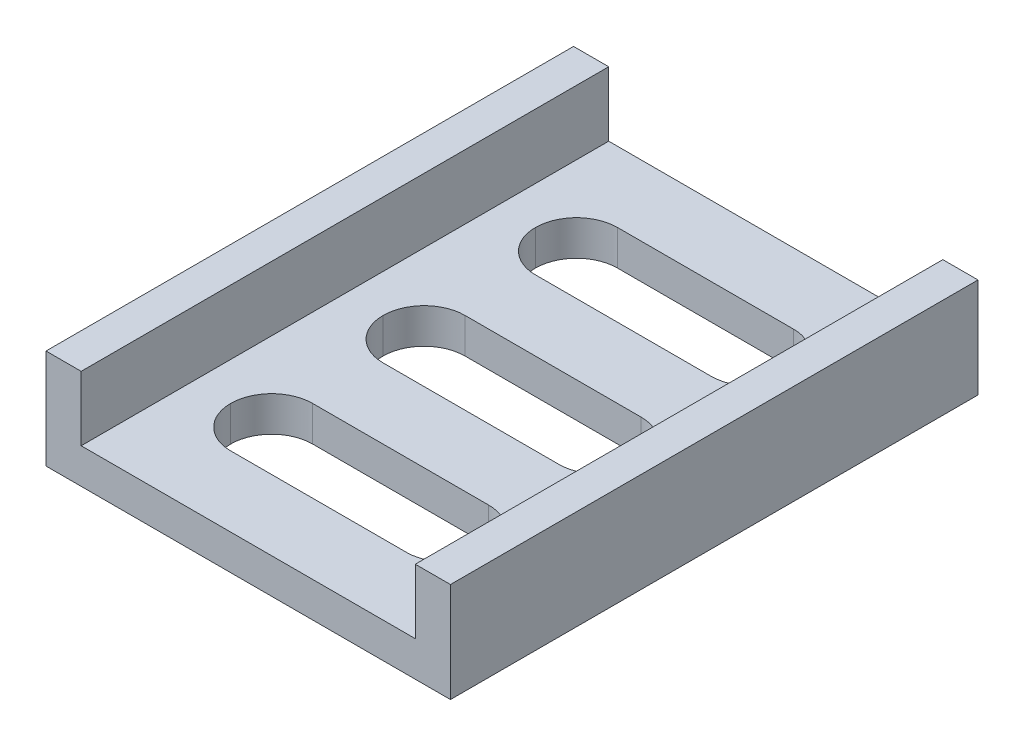
ISO-10303-21;
HEADER;
FILE_DESCRIPTION(('STEP AP214'),'2;1');
FILE_NAME('part.step','',(''),(''),'','','');
FILE_SCHEMA(('AUTOMOTIVE_DESIGN { 1 0 10303 214 1 1 1 1 }'));
ENDSEC;
DATA;
#1=APPLICATION_CONTEXT('core data for automotive mechanical design processes');
#2=APPLICATION_PROTOCOL_DEFINITION('international standard','automotive_design',2000,#1);
#3=PRODUCT_CONTEXT('',#1,'mechanical');
#4=PRODUCT('Part','Part','',(#3));
#5=PRODUCT_RELATED_PRODUCT_CATEGORY('part','',(#4));
#6=PRODUCT_DEFINITION_FORMATION('','',#4);
#7=PRODUCT_DEFINITION_CONTEXT('part definition',#1,'design');
#8=PRODUCT_DEFINITION('design','',#6,#7);
#9=PRODUCT_DEFINITION_SHAPE('','',#8);
#10=(LENGTH_UNIT() NAMED_UNIT(*) SI_UNIT(.MILLI.,.METRE.));
#11=(NAMED_UNIT(*) PLANE_ANGLE_UNIT() SI_UNIT($,.RADIAN.));
#12=(NAMED_UNIT(*) SI_UNIT($,.STERADIAN.) SOLID_ANGLE_UNIT());
#13=UNCERTAINTY_MEASURE_WITH_UNIT(LENGTH_MEASURE(1.E-05),#10,'distance_accuracy_value','');
#14=(GEOMETRIC_REPRESENTATION_CONTEXT(3) GLOBAL_UNCERTAINTY_ASSIGNED_CONTEXT((#13)) GLOBAL_UNIT_ASSIGNED_CONTEXT((#10,
#11,#12)) REPRESENTATION_CONTEXT('',''));
#15=CARTESIAN_POINT('',(0.,0.,0.));
#16=DIRECTION('',(0.,0.,1.));
#17=DIRECTION('',(1.,0.,0.));
#18=AXIS2_PLACEMENT_3D('',#15,#16,#17);
#19=CARTESIAN_POINT('',(0.,3.,0.));
#20=DIRECTION('',(0.,-1.,0.));
#21=DIRECTION('',(0.,0.,-1.));
#22=AXIS2_PLACEMENT_3D('',#19,#20,#21);
#23=PLANE('',#22);
#24=CARTESIAN_POINT('',(-7.49999999999998,3.,-13.));
#25=DIRECTION('',(0.,-1.,0.));
#26=DIRECTION('',(0.,0.,-1.));
#27=AXIS2_PLACEMENT_3D('',#24,#25,#26);
#28=CIRCLE('',#27,3.5);
#29=CARTESIAN_POINT('',(-7.49999999999998,3.,-9.5));
#30=VERTEX_POINT('',#29);
#31=CARTESIAN_POINT('',(-11.,3.,-13.));
#32=VERTEX_POINT('',#31);
#33=EDGE_CURVE('E305',#30,#32,#28,.T.);
#34=ORIENTED_EDGE('',*,*,#33,.T.);
#35=CARTESIAN_POINT('',(-7.49999999999998,3.,-13.));
#36=DIRECTION('',(0.,-1.,0.));
#37=DIRECTION('',(0.,0.,-1.));
#38=AXIS2_PLACEMENT_3D('',#35,#36,#37);
#39=CIRCLE('',#38,3.5);
#40=CARTESIAN_POINT('',(-7.49999999999998,3.,-16.5));
#41=VERTEX_POINT('',#40);
#42=EDGE_CURVE('E309',#32,#41,#39,.T.);
#43=ORIENTED_EDGE('',*,*,#42,.T.);
#44=DIRECTION('',(1.,0.,0.));
#45=VECTOR('',#44,1.);
#46=CARTESIAN_POINT('',(0.,3.,-16.5));
#47=LINE('',#46,#45);
#48=CARTESIAN_POINT('',(7.50000000000002,3.,-16.5));
#49=VERTEX_POINT('',#48);
#50=EDGE_CURVE('E730',#41,#49,#47,.T.);
#51=ORIENTED_EDGE('',*,*,#50,.T.);
#52=CARTESIAN_POINT('',(7.50000000000002,3.,-13.));
#53=DIRECTION('',(0.,-1.,0.));
#54=DIRECTION('',(0.,0.,-1.));
#55=AXIS2_PLACEMENT_3D('',#52,#53,#54);
#56=CIRCLE('',#55,3.5);
#57=CARTESIAN_POINT('',(11.,3.,-13.));
#58=VERTEX_POINT('',#57);
#59=EDGE_CURVE('E317',#49,#58,#56,.T.);
#60=ORIENTED_EDGE('',*,*,#59,.T.);
#61=CARTESIAN_POINT('',(7.50000000000002,3.,-13.));
#62=DIRECTION('',(0.,-1.,0.));
#63=DIRECTION('',(0.,0.,-1.));
#64=AXIS2_PLACEMENT_3D('',#61,#62,#63);
#65=CIRCLE('',#64,3.5);
#66=CARTESIAN_POINT('',(7.50000000000002,3.,-9.5));
#67=VERTEX_POINT('',#66);
#68=EDGE_CURVE('E313',#58,#67,#65,.T.);
#69=ORIENTED_EDGE('',*,*,#68,.T.);
#70=DIRECTION('',(-1.,0.,0.));
#71=VECTOR('',#70,1.);
#72=CARTESIAN_POINT('',(0.,3.,-9.5));
#73=LINE('',#72,#71);
#74=EDGE_CURVE('E733',#67,#30,#73,.T.);
#75=ORIENTED_EDGE('',*,*,#74,.T.);
#76=EDGE_LOOP('',(#34,#43,#51,#60,#69,#75));
#77=FACE_BOUND('',#76,.T.);
#78=DIRECTION('',(-1.,0.,0.));
#79=VECTOR('',#78,1.);
#80=CARTESIAN_POINT('',(0.,3.,3.5));
#81=LINE('',#80,#79);
#82=CARTESIAN_POINT('',(7.5,3.,3.5));
#83=VERTEX_POINT('',#82);
#84=CARTESIAN_POINT('',(-7.5,3.,3.5));
#85=VERTEX_POINT('',#84);
#86=EDGE_CURVE('E388',#83,#85,#81,.T.);
#87=ORIENTED_EDGE('',*,*,#86,.T.);
#88=CARTESIAN_POINT('',(-7.5,3.,0.));
#89=DIRECTION('',(0.,-1.,0.));
#90=DIRECTION('',(0.,0.,-1.));
#91=AXIS2_PLACEMENT_3D('',#88,#89,#90);
#92=CIRCLE('',#91,3.5);
#93=CARTESIAN_POINT('',(-11.,3.,0.));
#94=VERTEX_POINT('',#93);
#95=EDGE_CURVE('E329',#85,#94,#92,.T.);
#96=ORIENTED_EDGE('',*,*,#95,.T.);
#97=CARTESIAN_POINT('',(-7.5,3.,0.));
#98=DIRECTION('',(0.,-1.,0.));
#99=DIRECTION('',(0.,0.,-1.));
#100=AXIS2_PLACEMENT_3D('',#97,#98,#99);
#101=CIRCLE('',#100,3.5);
#102=CARTESIAN_POINT('',(-7.5,3.,-3.5));
#103=VERTEX_POINT('',#102);
#104=EDGE_CURVE('E325',#94,#103,#101,.T.);
#105=ORIENTED_EDGE('',*,*,#104,.T.);
#106=DIRECTION('',(1.,0.,0.));
#107=VECTOR('',#106,1.);
#108=CARTESIAN_POINT('',(0.,3.,-3.5));
#109=LINE('',#108,#107);
#110=CARTESIAN_POINT('',(7.5,3.,-3.5));
#111=VERTEX_POINT('',#110);
#112=EDGE_CURVE('E382',#103,#111,#109,.T.);
#113=ORIENTED_EDGE('',*,*,#112,.T.);
#114=CARTESIAN_POINT('',(7.5,3.,0.));
#115=DIRECTION('',(0.,-1.,0.));
#116=DIRECTION('',(0.,0.,-1.));
#117=AXIS2_PLACEMENT_3D('',#114,#115,#116);
#118=CIRCLE('',#117,3.5);
#119=CARTESIAN_POINT('',(11.,3.,0.));
#120=VERTEX_POINT('',#119);
#121=EDGE_CURVE('E321',#111,#120,#118,.T.);
#122=ORIENTED_EDGE('',*,*,#121,.T.);
#123=CARTESIAN_POINT('',(7.5,3.,0.));
#124=DIRECTION('',(0.,-1.,0.));
#125=DIRECTION('',(0.,0.,-1.));
#126=AXIS2_PLACEMENT_3D('',#123,#124,#125);
#127=CIRCLE('',#126,3.5);
#128=EDGE_CURVE('E333',#120,#83,#127,.T.);
#129=ORIENTED_EDGE('',*,*,#128,.T.);
#130=EDGE_LOOP('',(#87,#96,#105,#113,#122,#129));
#131=FACE_BOUND('',#130,.T.);
#132=DIRECTION('',(-1.,0.,0.));
#133=VECTOR('',#132,1.);
#134=CARTESIAN_POINT('',(0.,3.,16.5));
#135=LINE('',#134,#133);
#136=CARTESIAN_POINT('',(7.50000000000001,3.,16.5));
#137=VERTEX_POINT('',#136);
#138=CARTESIAN_POINT('',(-7.49999999999999,3.,16.5));
#139=VERTEX_POINT('',#138);
#140=EDGE_CURVE('E385',#137,#139,#135,.T.);
#141=ORIENTED_EDGE('',*,*,#140,.T.);
#142=CARTESIAN_POINT('',(-7.49999999999999,3.,13.));
#143=DIRECTION('',(0.,-1.,0.));
#144=DIRECTION('',(0.,0.,-1.));
#145=AXIS2_PLACEMENT_3D('',#142,#143,#144);
#146=CIRCLE('',#145,3.5);
#147=CARTESIAN_POINT('',(-11.,3.,13.));
#148=VERTEX_POINT('',#147);
#149=EDGE_CURVE('E11',#139,#148,#146,.T.);
#150=ORIENTED_EDGE('',*,*,#149,.T.);
#151=CARTESIAN_POINT('',(-7.49999999999999,3.,13.));
#152=DIRECTION('',(0.,-1.,0.));
#153=DIRECTION('',(0.,0.,-1.));
#154=AXIS2_PLACEMENT_3D('',#151,#152,#153);
#155=CIRCLE('',#154,3.5);
#156=CARTESIAN_POINT('',(-7.49999999999999,3.,9.5));
#157=VERTEX_POINT('',#156);
#158=EDGE_CURVE('E344',#148,#157,#155,.T.);
#159=ORIENTED_EDGE('',*,*,#158,.T.);
#160=DIRECTION('',(1.,0.,0.));
#161=VECTOR('',#160,1.);
#162=CARTESIAN_POINT('',(0.,3.,9.5));
#163=LINE('',#162,#161);
#164=CARTESIAN_POINT('',(7.50000000000001,3.,9.5));
#165=VERTEX_POINT('',#164);
#166=EDGE_CURVE('E393',#157,#165,#163,.T.);
#167=ORIENTED_EDGE('',*,*,#166,.T.);
#168=CARTESIAN_POINT('',(7.50000000000001,3.,13.));
#169=DIRECTION('',(0.,-1.,0.));
#170=DIRECTION('',(0.,0.,-1.));
#171=AXIS2_PLACEMENT_3D('',#168,#169,#170);
#172=CIRCLE('',#171,3.5);
#173=CARTESIAN_POINT('',(11.,3.,13.));
#174=VERTEX_POINT('',#173);
#175=EDGE_CURVE('E337',#165,#174,#172,.T.);
#176=ORIENTED_EDGE('',*,*,#175,.T.);
#177=CARTESIAN_POINT('',(7.50000000000001,3.,13.));
#178=DIRECTION('',(0.,-1.,0.));
#179=DIRECTION('',(0.,0.,-1.));
#180=AXIS2_PLACEMENT_3D('',#177,#178,#179);
#181=CIRCLE('',#180,3.5);
#182=EDGE_CURVE('E341',#174,#137,#181,.T.);
#183=ORIENTED_EDGE('',*,*,#182,.T.);
#184=EDGE_LOOP('',(#141,#150,#159,#167,#176,#183));
#185=FACE_BOUND('',#184,.T.);
#186=DIRECTION('',(0.,0.,1.));
#187=VECTOR('',#186,1.);
#188=CARTESIAN_POINT('',(14.25,3.,-22.5));
#189=LINE('',#188,#187);
#190=CARTESIAN_POINT('',(14.25,3.,-22.5));
#191=VERTEX_POINT('',#190);
#192=CARTESIAN_POINT('',(14.25,3.,22.5));
#193=VERTEX_POINT('',#192);
#194=EDGE_CURVE('E229',#191,#193,#189,.T.);
#195=ORIENTED_EDGE('',*,*,#194,.F.);
#196=DIRECTION('',(-1.,0.,0.));
#197=VECTOR('',#196,1.);
#198=CARTESIAN_POINT('',(-17.25,3.,-22.5));
#199=LINE('',#198,#197);
#200=CARTESIAN_POINT('',(-14.25,3.,-22.5));
#201=VERTEX_POINT('',#200);
#202=EDGE_CURVE('E234',#191,#201,#199,.T.);
#203=ORIENTED_EDGE('',*,*,#202,.T.);
#204=DIRECTION('',(0.,0.,-1.));
#205=VECTOR('',#204,1.);
#206=CARTESIAN_POINT('',(-14.25,3.,-22.5));
#207=LINE('',#206,#205);
#208=CARTESIAN_POINT('',(-14.25,3.,22.5));
#209=VERTEX_POINT('',#208);
#210=EDGE_CURVE('E235',#209,#201,#207,.T.);
#211=ORIENTED_EDGE('',*,*,#210,.F.);
#212=DIRECTION('',(1.,0.,0.));
#213=VECTOR('',#212,1.);
#214=CARTESIAN_POINT('',(-17.25,3.,22.5));
#215=LINE('',#214,#213);
#216=EDGE_CURVE('E259',#209,#193,#215,.T.);
#217=ORIENTED_EDGE('',*,*,#216,.T.);
#218=EDGE_LOOP('',(#195,#203,#211,#217));
#219=FACE_BOUND('',#218,.T.);
#220=ADVANCED_FACE('F34',(#77,#131,#185,#219),#23,.F.);
#221=CARTESIAN_POINT('',(17.25,3.,22.5));
#222=DIRECTION('',(-1.,0.,0.));
#223=DIRECTION('',(0.,0.,1.));
#224=AXIS2_PLACEMENT_3D('',#221,#222,#223);
#225=PLANE('',#224);
#226=DIRECTION('',(0.,0.,-1.));
#227=VECTOR('',#226,1.);
#228=CARTESIAN_POINT('',(17.25,0.,22.5));
#229=LINE('',#228,#227);
#230=CARTESIAN_POINT('',(17.25,0.,22.5));
#231=VERTEX_POINT('',#230);
#232=CARTESIAN_POINT('',(17.25,0.,-22.5));
#233=VERTEX_POINT('',#232);
#234=EDGE_CURVE('E267',#231,#233,#229,.T.);
#235=ORIENTED_EDGE('',*,*,#234,.T.);
#236=DIRECTION('',(0.,-1.,0.));
#237=VECTOR('',#236,1.);
#238=CARTESIAN_POINT('',(17.25,3.,-22.5));
#239=LINE('',#238,#237);
#240=CARTESIAN_POINT('',(17.25,8.5,-22.5));
#241=VERTEX_POINT('',#240);
#242=EDGE_CURVE('E276',#241,#233,#239,.T.);
#243=ORIENTED_EDGE('',*,*,#242,.F.);
#244=DIRECTION('',(0.,0.,-1.));
#245=VECTOR('',#244,1.);
#246=CARTESIAN_POINT('',(17.25,8.5,-22.5));
#247=LINE('',#246,#245);
#248=CARTESIAN_POINT('',(17.25,8.5,22.5));
#249=VERTEX_POINT('',#248);
#250=EDGE_CURVE('E226',#249,#241,#247,.T.);
#251=ORIENTED_EDGE('',*,*,#250,.F.);
#252=DIRECTION('',(0.,-1.,0.));
#253=VECTOR('',#252,1.);
#254=CARTESIAN_POINT('',(17.25,3.,22.5));
#255=LINE('',#254,#253);
#256=EDGE_CURVE('E403',#249,#231,#255,.T.);
#257=ORIENTED_EDGE('',*,*,#256,.T.);
#258=EDGE_LOOP('',(#235,#243,#251,#257));
#259=FACE_BOUND('',#258,.T.);
#260=ADVANCED_FACE('F406',(#259),#225,.F.);
#261=CARTESIAN_POINT('',(-17.25,3.,-22.5));
#262=DIRECTION('',(0.,0.,1.));
#263=DIRECTION('',(1.,0.,0.));
#264=AXIS2_PLACEMENT_3D('',#261,#262,#263);
#265=PLANE('',#264);
#266=DIRECTION('',(-1.,0.,0.));
#267=VECTOR('',#266,1.);
#268=CARTESIAN_POINT('',(-17.25,0.,-22.5));
#269=LINE('',#268,#267);
#270=CARTESIAN_POINT('',(-17.25,0.,-22.5));
#271=VERTEX_POINT('',#270);
#272=EDGE_CURVE('E419',#233,#271,#269,.T.);
#273=ORIENTED_EDGE('',*,*,#272,.T.);
#274=DIRECTION('',(0.,-1.,0.));
#275=VECTOR('',#274,1.);
#276=CARTESIAN_POINT('',(-17.25,3.,-22.5));
#277=LINE('',#276,#275);
#278=CARTESIAN_POINT('',(-17.25,8.5,-22.5));
#279=VERTEX_POINT('',#278);
#280=EDGE_CURVE('E408',#279,#271,#277,.T.);
#281=ORIENTED_EDGE('',*,*,#280,.F.);
#282=DIRECTION('',(-1.,0.,0.));
#283=VECTOR('',#282,1.);
#284=CARTESIAN_POINT('',(-14.25,8.5,-22.5));
#285=LINE('',#284,#283);
#286=CARTESIAN_POINT('',(-14.25,8.5,-22.5));
#287=VERTEX_POINT('',#286);
#288=EDGE_CURVE('E238',#287,#279,#285,.T.);
#289=ORIENTED_EDGE('',*,*,#288,.F.);
#290=DIRECTION('',(0.,-1.,0.));
#291=VECTOR('',#290,1.);
#292=CARTESIAN_POINT('',(-14.25,8.5,-22.5));
#293=LINE('',#292,#291);
#294=EDGE_CURVE('E252',#287,#201,#293,.T.);
#295=ORIENTED_EDGE('',*,*,#294,.T.);
#296=ORIENTED_EDGE('',*,*,#202,.F.);
#297=DIRECTION('',(0.,-1.,0.));
#298=VECTOR('',#297,1.);
#299=CARTESIAN_POINT('',(14.25,8.5,-22.5));
#300=LINE('',#299,#298);
#301=CARTESIAN_POINT('',(14.25,8.5,-22.5));
#302=VERTEX_POINT('',#301);
#303=EDGE_CURVE('E213',#302,#191,#300,.T.);
#304=ORIENTED_EDGE('',*,*,#303,.F.);
#305=DIRECTION('',(-1.,0.,0.));
#306=VECTOR('',#305,1.);
#307=CARTESIAN_POINT('',(14.25,8.5,-22.5));
#308=LINE('',#307,#306);
#309=EDGE_CURVE('E220',#241,#302,#308,.T.);
#310=ORIENTED_EDGE('',*,*,#309,.F.);
#311=ORIENTED_EDGE('',*,*,#242,.T.);
#312=EDGE_LOOP('',(#273,#281,#289,#295,#296,#304,#310,#311));
#313=FACE_BOUND('',#312,.T.);
#314=ADVANCED_FACE('F232',(#313),#265,.F.);
#315=CARTESIAN_POINT('',(-17.25,3.,22.5));
#316=DIRECTION('',(1.,0.,0.));
#317=DIRECTION('',(0.,0.,-1.));
#318=AXIS2_PLACEMENT_3D('',#315,#316,#317);
#319=PLANE('',#318);
#320=DIRECTION('',(0.,0.,1.));
#321=VECTOR('',#320,1.);
#322=CARTESIAN_POINT('',(-17.25,0.,22.5));
#323=LINE('',#322,#321);
#324=CARTESIAN_POINT('',(-17.25,0.,22.5));
#325=VERTEX_POINT('',#324);
#326=EDGE_CURVE('E417',#271,#325,#323,.T.);
#327=ORIENTED_EDGE('',*,*,#326,.T.);
#328=DIRECTION('',(0.,-1.,0.));
#329=VECTOR('',#328,1.);
#330=CARTESIAN_POINT('',(-17.25,3.,22.5));
#331=LINE('',#330,#329);
#332=CARTESIAN_POINT('',(-17.25,8.5,22.5));
#333=VERTEX_POINT('',#332);
#334=EDGE_CURVE('E410',#333,#325,#331,.T.);
#335=ORIENTED_EDGE('',*,*,#334,.F.);
#336=DIRECTION('',(0.,0.,1.));
#337=VECTOR('',#336,1.);
#338=CARTESIAN_POINT('',(-17.25,8.5,-22.5));
#339=LINE('',#338,#337);
#340=EDGE_CURVE('E245',#279,#333,#339,.T.);
#341=ORIENTED_EDGE('',*,*,#340,.F.);
#342=ORIENTED_EDGE('',*,*,#280,.T.);
#343=EDGE_LOOP('',(#327,#335,#341,#342));
#344=FACE_BOUND('',#343,.T.);
#345=ADVANCED_FACE('F426',(#344),#319,.F.);
#346=CARTESIAN_POINT('',(-17.25,3.,22.5));
#347=DIRECTION('',(0.,0.,-1.));
#348=DIRECTION('',(-1.,0.,0.));
#349=AXIS2_PLACEMENT_3D('',#346,#347,#348);
#350=PLANE('',#349);
#351=DIRECTION('',(1.,0.,0.));
#352=VECTOR('',#351,1.);
#353=CARTESIAN_POINT('',(-17.25,0.,22.5));
#354=LINE('',#353,#352);
#355=EDGE_CURVE('E271',#325,#231,#354,.T.);
#356=ORIENTED_EDGE('',*,*,#355,.T.);
#357=ORIENTED_EDGE('',*,*,#256,.F.);
#358=DIRECTION('',(1.,0.,0.));
#359=VECTOR('',#358,1.);
#360=CARTESIAN_POINT('',(17.25,8.5,22.5));
#361=LINE('',#360,#359);
#362=CARTESIAN_POINT('',(14.25,8.5,22.5));
#363=VERTEX_POINT('',#362);
#364=EDGE_CURVE('E219',#363,#249,#361,.T.);
#365=ORIENTED_EDGE('',*,*,#364,.F.);
#366=DIRECTION('',(0.,-1.,0.));
#367=VECTOR('',#366,1.);
#368=CARTESIAN_POINT('',(14.25,8.5,22.5));
#369=LINE('',#368,#367);
#370=EDGE_CURVE('E215',#363,#193,#369,.T.);
#371=ORIENTED_EDGE('',*,*,#370,.T.);
#372=ORIENTED_EDGE('',*,*,#216,.F.);
#373=DIRECTION('',(0.,-1.,0.));
#374=VECTOR('',#373,1.);
#375=CARTESIAN_POINT('',(-14.25,8.5,22.5));
#376=LINE('',#375,#374);
#377=CARTESIAN_POINT('',(-14.25,8.5,22.5));
#378=VERTEX_POINT('',#377);
#379=EDGE_CURVE('E262',#378,#209,#376,.T.);
#380=ORIENTED_EDGE('',*,*,#379,.F.);
#381=DIRECTION('',(1.,0.,0.));
#382=VECTOR('',#381,1.);
#383=CARTESIAN_POINT('',(-17.25,8.5,22.5));
#384=LINE('',#383,#382);
#385=EDGE_CURVE('E248',#333,#378,#384,.T.);
#386=ORIENTED_EDGE('',*,*,#385,.F.);
#387=ORIENTED_EDGE('',*,*,#334,.T.);
#388=EDGE_LOOP('',(#356,#357,#365,#371,#372,#380,#386,#387));
#389=FACE_BOUND('',#388,.T.);
#390=ADVANCED_FACE('F400',(#389),#350,.F.);
#391=CARTESIAN_POINT('',(0.,0.,0.));
#392=DIRECTION('',(0.,-1.,0.));
#393=DIRECTION('',(0.,0.,-1.));
#394=AXIS2_PLACEMENT_3D('',#391,#392,#393);
#395=PLANE('',#394);
#396=CARTESIAN_POINT('',(7.50000000000002,0.,-13.));
#397=DIRECTION('',(0.,-1.,0.));
#398=DIRECTION('',(0.,0.,-1.));
#399=AXIS2_PLACEMENT_3D('',#396,#397,#398);
#400=CIRCLE('',#399,3.5);
#401=CARTESIAN_POINT('',(7.50000000000002,0.,-9.5));
#402=VERTEX_POINT('',#401);
#403=CARTESIAN_POINT('',(11.,0.,-13.));
#404=VERTEX_POINT('',#403);
#405=EDGE_CURVE('E311',#402,#404,#400,.F.);
#406=ORIENTED_EDGE('',*,*,#405,.T.);
#407=CARTESIAN_POINT('',(7.50000000000002,0.,-13.));
#408=DIRECTION('',(0.,-1.,0.));
#409=DIRECTION('',(0.,0.,-1.));
#410=AXIS2_PLACEMENT_3D('',#407,#408,#409);
#411=CIRCLE('',#410,3.5);
#412=CARTESIAN_POINT('',(7.50000000000002,0.,-16.5));
#413=VERTEX_POINT('',#412);
#414=EDGE_CURVE('E315',#404,#413,#411,.F.);
#415=ORIENTED_EDGE('',*,*,#414,.T.);
#416=DIRECTION('',(1.,0.,0.));
#417=VECTOR('',#416,1.);
#418=CARTESIAN_POINT('',(-11.,0.,-16.5));
#419=LINE('',#418,#417);
#420=CARTESIAN_POINT('',(-7.49999999999998,0.,-16.5));
#421=VERTEX_POINT('',#420);
#422=EDGE_CURVE('E741',#421,#413,#419,.T.);
#423=ORIENTED_EDGE('',*,*,#422,.F.);
#424=CARTESIAN_POINT('',(-7.49999999999998,0.,-13.));
#425=DIRECTION('',(0.,-1.,0.));
#426=DIRECTION('',(0.,0.,-1.));
#427=AXIS2_PLACEMENT_3D('',#424,#425,#426);
#428=CIRCLE('',#427,3.5);
#429=CARTESIAN_POINT('',(-11.,0.,-13.));
#430=VERTEX_POINT('',#429);
#431=EDGE_CURVE('E307',#421,#430,#428,.F.);
#432=ORIENTED_EDGE('',*,*,#431,.T.);
#433=CARTESIAN_POINT('',(-7.49999999999998,0.,-13.));
#434=DIRECTION('',(0.,-1.,0.));
#435=DIRECTION('',(0.,0.,-1.));
#436=AXIS2_PLACEMENT_3D('',#433,#434,#435);
#437=CIRCLE('',#436,3.5);
#438=CARTESIAN_POINT('',(-7.49999999999998,0.,-9.5));
#439=VERTEX_POINT('',#438);
#440=EDGE_CURVE('E303',#430,#439,#437,.F.);
#441=ORIENTED_EDGE('',*,*,#440,.T.);
#442=DIRECTION('',(-1.,0.,0.));
#443=VECTOR('',#442,1.);
#444=CARTESIAN_POINT('',(-11.,0.,-9.5));
#445=LINE('',#444,#443);
#446=EDGE_CURVE('E350',#402,#439,#445,.T.);
#447=ORIENTED_EDGE('',*,*,#446,.F.);
#448=EDGE_LOOP('',(#406,#415,#423,#432,#441,#447));
#449=FACE_BOUND('',#448,.T.);
#450=DIRECTION('',(-1.,0.,0.));
#451=VECTOR('',#450,1.);
#452=CARTESIAN_POINT('',(-11.,0.,3.5));
#453=LINE('',#452,#451);
#454=CARTESIAN_POINT('',(7.5,0.,3.5));
#455=VERTEX_POINT('',#454);
#456=CARTESIAN_POINT('',(-7.5,0.,3.5));
#457=VERTEX_POINT('',#456);
#458=EDGE_CURVE('E717',#455,#457,#453,.T.);
#459=ORIENTED_EDGE('',*,*,#458,.F.);
#460=CARTESIAN_POINT('',(7.5,0.,0.));
#461=DIRECTION('',(0.,-1.,0.));
#462=DIRECTION('',(0.,0.,-1.));
#463=AXIS2_PLACEMENT_3D('',#460,#461,#462);
#464=CIRCLE('',#463,3.5);
#465=CARTESIAN_POINT('',(11.,0.,0.));
#466=VERTEX_POINT('',#465);
#467=EDGE_CURVE('E331',#455,#466,#464,.F.);
#468=ORIENTED_EDGE('',*,*,#467,.T.);
#469=CARTESIAN_POINT('',(7.5,0.,0.));
#470=DIRECTION('',(0.,-1.,0.));
#471=DIRECTION('',(0.,0.,-1.));
#472=AXIS2_PLACEMENT_3D('',#469,#470,#471);
#473=CIRCLE('',#472,3.5);
#474=CARTESIAN_POINT('',(7.5,0.,-3.5));
#475=VERTEX_POINT('',#474);
#476=EDGE_CURVE('E319',#466,#475,#473,.F.);
#477=ORIENTED_EDGE('',*,*,#476,.T.);
#478=DIRECTION('',(1.,0.,0.));
#479=VECTOR('',#478,1.);
#480=CARTESIAN_POINT('',(-11.,0.,-3.5));
#481=LINE('',#480,#479);
#482=CARTESIAN_POINT('',(-7.5,0.,-3.5));
#483=VERTEX_POINT('',#482);
#484=EDGE_CURVE('E712',#483,#475,#481,.T.);
#485=ORIENTED_EDGE('',*,*,#484,.F.);
#486=CARTESIAN_POINT('',(-7.5,0.,0.));
#487=DIRECTION('',(0.,-1.,0.));
#488=DIRECTION('',(0.,0.,-1.));
#489=AXIS2_PLACEMENT_3D('',#486,#487,#488);
#490=CIRCLE('',#489,3.5);
#491=CARTESIAN_POINT('',(-11.,0.,0.));
#492=VERTEX_POINT('',#491);
#493=EDGE_CURVE('E323',#483,#492,#490,.F.);
#494=ORIENTED_EDGE('',*,*,#493,.T.);
#495=CARTESIAN_POINT('',(-7.5,0.,0.));
#496=DIRECTION('',(0.,-1.,0.));
#497=DIRECTION('',(0.,0.,-1.));
#498=AXIS2_PLACEMENT_3D('',#495,#496,#497);
#499=CIRCLE('',#498,3.5);
#500=EDGE_CURVE('E327',#492,#457,#499,.F.);
#501=ORIENTED_EDGE('',*,*,#500,.T.);
#502=EDGE_LOOP('',(#459,#468,#477,#485,#494,#501));
#503=FACE_BOUND('',#502,.T.);
#504=DIRECTION('',(-1.,0.,0.));
#505=VECTOR('',#504,1.);
#506=CARTESIAN_POINT('',(-11.,0.,16.5));
#507=LINE('',#506,#505);
#508=CARTESIAN_POINT('',(7.50000000000001,0.,16.5));
#509=VERTEX_POINT('',#508);
#510=CARTESIAN_POINT('',(-7.49999999999999,0.,16.5));
#511=VERTEX_POINT('',#510);
#512=EDGE_CURVE('E375',#509,#511,#507,.T.);
#513=ORIENTED_EDGE('',*,*,#512,.F.);
#514=CARTESIAN_POINT('',(7.50000000000001,0.,13.));
#515=DIRECTION('',(0.,-1.,0.));
#516=DIRECTION('',(0.,0.,-1.));
#517=AXIS2_PLACEMENT_3D('',#514,#515,#516);
#518=CIRCLE('',#517,3.5);
#519=CARTESIAN_POINT('',(11.,0.,13.));
#520=VERTEX_POINT('',#519);
#521=EDGE_CURVE('E339',#509,#520,#518,.F.);
#522=ORIENTED_EDGE('',*,*,#521,.T.);
#523=CARTESIAN_POINT('',(7.50000000000001,0.,13.));
#524=DIRECTION('',(0.,-1.,0.));
#525=DIRECTION('',(0.,0.,-1.));
#526=AXIS2_PLACEMENT_3D('',#523,#524,#525);
#527=CIRCLE('',#526,3.5);
#528=CARTESIAN_POINT('',(7.50000000000001,0.,9.5));
#529=VERTEX_POINT('',#528);
#530=EDGE_CURVE('E335',#520,#529,#527,.F.);
#531=ORIENTED_EDGE('',*,*,#530,.T.);
#532=DIRECTION('',(1.,0.,0.));
#533=VECTOR('',#532,1.);
#534=CARTESIAN_POINT('',(-11.,0.,9.5));
#535=LINE('',#534,#533);
#536=CARTESIAN_POINT('',(-7.49999999999999,0.,9.5));
#537=VERTEX_POINT('',#536);
#538=EDGE_CURVE('E381',#537,#529,#535,.T.);
#539=ORIENTED_EDGE('',*,*,#538,.F.);
#540=CARTESIAN_POINT('',(-7.49999999999999,0.,13.));
#541=DIRECTION('',(0.,-1.,0.));
#542=DIRECTION('',(0.,0.,-1.));
#543=AXIS2_PLACEMENT_3D('',#540,#541,#542);
#544=CIRCLE('',#543,3.5);
#545=CARTESIAN_POINT('',(-11.,0.,13.));
#546=VERTEX_POINT('',#545);
#547=EDGE_CURVE('E57',#537,#546,#544,.F.);
#548=ORIENTED_EDGE('',*,*,#547,.T.);
#549=CARTESIAN_POINT('',(-7.49999999999999,0.,13.));
#550=DIRECTION('',(0.,-1.,0.));
#551=DIRECTION('',(0.,0.,-1.));
#552=AXIS2_PLACEMENT_3D('',#549,#550,#551);
#553=CIRCLE('',#552,3.5);
#554=EDGE_CURVE('E43',#546,#511,#553,.F.);
#555=ORIENTED_EDGE('',*,*,#554,.T.);
#556=EDGE_LOOP('',(#513,#522,#531,#539,#548,#555));
#557=FACE_BOUND('',#556,.T.);
#558=ORIENTED_EDGE('',*,*,#234,.F.);
#559=ORIENTED_EDGE('',*,*,#355,.F.);
#560=ORIENTED_EDGE('',*,*,#326,.F.);
#561=ORIENTED_EDGE('',*,*,#272,.F.);
#562=EDGE_LOOP('',(#558,#559,#560,#561));
#563=FACE_BOUND('',#562,.T.);
#564=ADVANCED_FACE('F373',(#449,#503,#557,#563),#395,.T.);
#565=CARTESIAN_POINT('',(-14.25,8.5,-22.5));
#566=DIRECTION('',(-1.,0.,0.));
#567=DIRECTION('',(0.,0.,1.));
#568=AXIS2_PLACEMENT_3D('',#565,#566,#567);
#569=PLANE('',#568);
#570=ORIENTED_EDGE('',*,*,#210,.T.);
#571=ORIENTED_EDGE('',*,*,#294,.F.);
#572=DIRECTION('',(0.,0.,-1.));
#573=VECTOR('',#572,1.);
#574=CARTESIAN_POINT('',(-14.25,8.5,-22.5));
#575=LINE('',#574,#573);
#576=EDGE_CURVE('E250',#378,#287,#575,.T.);
#577=ORIENTED_EDGE('',*,*,#576,.F.);
#578=ORIENTED_EDGE('',*,*,#379,.T.);
#579=EDGE_LOOP('',(#570,#571,#577,#578));
#580=FACE_BOUND('',#579,.T.);
#581=ADVANCED_FACE('F434',(#580),#569,.F.);
#582=CARTESIAN_POINT('',(0.,8.5,0.));
#583=DIRECTION('',(0.,1.,0.));
#584=DIRECTION('',(0.,0.,1.));
#585=AXIS2_PLACEMENT_3D('',#582,#583,#584);
#586=PLANE('',#585);
#587=ORIENTED_EDGE('',*,*,#288,.T.);
#588=ORIENTED_EDGE('',*,*,#340,.T.);
#589=ORIENTED_EDGE('',*,*,#385,.T.);
#590=ORIENTED_EDGE('',*,*,#576,.T.);
#591=EDGE_LOOP('',(#587,#588,#589,#590));
#592=FACE_BOUND('',#591,.T.);
#593=ADVANCED_FACE('F430',(#592),#586,.T.);
#594=CARTESIAN_POINT('',(14.25,8.5,-22.5));
#595=DIRECTION('',(1.,0.,0.));
#596=DIRECTION('',(0.,0.,-1.));
#597=AXIS2_PLACEMENT_3D('',#594,#595,#596);
#598=PLANE('',#597);
#599=ORIENTED_EDGE('',*,*,#194,.T.);
#600=ORIENTED_EDGE('',*,*,#370,.F.);
#601=DIRECTION('',(0.,0.,1.));
#602=VECTOR('',#601,1.);
#603=CARTESIAN_POINT('',(14.25,8.5,-22.5));
#604=LINE('',#603,#602);
#605=EDGE_CURVE('E208',#302,#363,#604,.T.);
#606=ORIENTED_EDGE('',*,*,#605,.F.);
#607=ORIENTED_EDGE('',*,*,#303,.T.);
#608=EDGE_LOOP('',(#599,#600,#606,#607));
#609=FACE_BOUND('',#608,.T.);
#610=ADVANCED_FACE('F211',(#609),#598,.F.);
#611=CARTESIAN_POINT('',(0.,8.5,0.));
#612=DIRECTION('',(0.,-1.,0.));
#613=DIRECTION('',(0.,0.,-1.));
#614=AXIS2_PLACEMENT_3D('',#611,#612,#613);
#615=PLANE('',#614);
#616=ORIENTED_EDGE('',*,*,#309,.T.);
#617=ORIENTED_EDGE('',*,*,#605,.T.);
#618=ORIENTED_EDGE('',*,*,#364,.T.);
#619=ORIENTED_EDGE('',*,*,#250,.T.);
#620=EDGE_LOOP('',(#616,#617,#618,#619));
#621=FACE_BOUND('',#620,.T.);
#622=ADVANCED_FACE('F224',(#621),#615,.F.);
#623=CARTESIAN_POINT('',(-11.,8.,9.5));
#624=DIRECTION('',(0.,0.,-1.));
#625=DIRECTION('',(-1.,0.,0.));
#626=AXIS2_PLACEMENT_3D('',#623,#624,#625);
#627=PLANE('',#626);
#628=ORIENTED_EDGE('',*,*,#538,.T.);
#629=DIRECTION('',(0.,-1.,0.));
#630=VECTOR('',#629,1.);
#631=CARTESIAN_POINT('',(7.50000000000001,3.,9.5));
#632=LINE('',#631,#630);
#633=EDGE_CURVE('E296',#529,#165,#632,.F.);
#634=ORIENTED_EDGE('',*,*,#633,.T.);
#635=ORIENTED_EDGE('',*,*,#166,.F.);
#636=DIRECTION('',(0.,-1.,0.));
#637=VECTOR('',#636,1.);
#638=CARTESIAN_POINT('',(-7.49999999999999,0.,9.5));
#639=LINE('',#638,#637);
#640=EDGE_CURVE('E293',#157,#537,#639,.T.);
#641=ORIENTED_EDGE('',*,*,#640,.T.);
#642=EDGE_LOOP('',(#628,#634,#635,#641));
#643=FACE_BOUND('',#642,.T.);
#644=ADVANCED_FACE('F577',(#643),#627,.F.);
#645=CARTESIAN_POINT('',(-11.,8.,16.5));
#646=DIRECTION('',(0.,0.,1.));
#647=DIRECTION('',(1.,0.,0.));
#648=AXIS2_PLACEMENT_3D('',#645,#646,#647);
#649=PLANE('',#648);
#650=ORIENTED_EDGE('',*,*,#140,.F.);
#651=DIRECTION('',(0.,-1.,0.));
#652=VECTOR('',#651,1.);
#653=CARTESIAN_POINT('',(7.50000000000001,0.,16.5));
#654=LINE('',#653,#652);
#655=EDGE_CURVE('E301',#137,#509,#654,.T.);
#656=ORIENTED_EDGE('',*,*,#655,.T.);
#657=ORIENTED_EDGE('',*,*,#512,.T.);
#658=DIRECTION('',(0.,-1.,0.));
#659=VECTOR('',#658,1.);
#660=CARTESIAN_POINT('',(-7.49999999999999,3.,16.5));
#661=LINE('',#660,#659);
#662=EDGE_CURVE('E299',#511,#139,#661,.F.);
#663=ORIENTED_EDGE('',*,*,#662,.T.);
#664=EDGE_LOOP('',(#650,#656,#657,#663));
#665=FACE_BOUND('',#664,.T.);
#666=ADVANCED_FACE('F379',(#665),#649,.F.);
#667=CARTESIAN_POINT('',(-11.,8.,-3.5));
#668=DIRECTION('',(0.,0.,-1.));
#669=DIRECTION('',(-1.,0.,0.));
#670=AXIS2_PLACEMENT_3D('',#667,#668,#669);
#671=PLANE('',#670);
#672=ORIENTED_EDGE('',*,*,#484,.T.);
#673=DIRECTION('',(0.,-1.,0.));
#674=VECTOR('',#673,1.);
#675=CARTESIAN_POINT('',(7.5,3.,-3.5));
#676=LINE('',#675,#674);
#677=EDGE_CURVE('E286',#475,#111,#676,.F.);
#678=ORIENTED_EDGE('',*,*,#677,.T.);
#679=ORIENTED_EDGE('',*,*,#112,.F.);
#680=DIRECTION('',(0.,-1.,0.));
#681=VECTOR('',#680,1.);
#682=CARTESIAN_POINT('',(-7.5,0.,-3.5));
#683=LINE('',#682,#681);
#684=EDGE_CURVE('E283',#103,#483,#683,.T.);
#685=ORIENTED_EDGE('',*,*,#684,.T.);
#686=EDGE_LOOP('',(#672,#678,#679,#685));
#687=FACE_BOUND('',#686,.T.);
#688=ADVANCED_FACE('F562',(#687),#671,.F.);
#689=CARTESIAN_POINT('',(-11.,8.,3.5));
#690=DIRECTION('',(0.,0.,1.));
#691=DIRECTION('',(1.,0.,0.));
#692=AXIS2_PLACEMENT_3D('',#689,#690,#691);
#693=PLANE('',#692);
#694=ORIENTED_EDGE('',*,*,#458,.T.);
#695=DIRECTION('',(0.,-1.,0.));
#696=VECTOR('',#695,1.);
#697=CARTESIAN_POINT('',(-7.5,3.,3.5));
#698=LINE('',#697,#696);
#699=EDGE_CURVE('E291',#457,#85,#698,.F.);
#700=ORIENTED_EDGE('',*,*,#699,.T.);
#701=ORIENTED_EDGE('',*,*,#86,.F.);
#702=DIRECTION('',(0.,-1.,0.));
#703=VECTOR('',#702,1.);
#704=CARTESIAN_POINT('',(7.5,0.,3.5));
#705=LINE('',#704,#703);
#706=EDGE_CURVE('E289',#83,#455,#705,.T.);
#707=ORIENTED_EDGE('',*,*,#706,.T.);
#708=EDGE_LOOP('',(#694,#700,#701,#707));
#709=FACE_BOUND('',#708,.T.);
#710=ADVANCED_FACE('F554',(#709),#693,.F.);
#711=CARTESIAN_POINT('',(-11.,8.,-16.5));
#712=DIRECTION('',(0.,0.,-1.));
#713=DIRECTION('',(-1.,0.,0.));
#714=AXIS2_PLACEMENT_3D('',#711,#712,#713);
#715=PLANE('',#714);
#716=ORIENTED_EDGE('',*,*,#50,.F.);
#717=DIRECTION('',(0.,-1.,0.));
#718=VECTOR('',#717,1.);
#719=CARTESIAN_POINT('',(-7.49999999999998,0.,-16.5));
#720=LINE('',#719,#718);
#721=EDGE_CURVE('E281',#41,#421,#720,.T.);
#722=ORIENTED_EDGE('',*,*,#721,.T.);
#723=ORIENTED_EDGE('',*,*,#422,.T.);
#724=DIRECTION('',(0.,-1.,0.));
#725=VECTOR('',#724,1.);
#726=CARTESIAN_POINT('',(7.50000000000002,3.,-16.5));
#727=LINE('',#726,#725);
#728=EDGE_CURVE('E279',#413,#49,#727,.F.);
#729=ORIENTED_EDGE('',*,*,#728,.T.);
#730=EDGE_LOOP('',(#716,#722,#723,#729));
#731=FACE_BOUND('',#730,.T.);
#732=ADVANCED_FACE('F546',(#731),#715,.F.);
#733=CARTESIAN_POINT('',(-11.,8.,-9.5));
#734=DIRECTION('',(0.,0.,1.));
#735=DIRECTION('',(1.,0.,0.));
#736=AXIS2_PLACEMENT_3D('',#733,#734,#735);
#737=PLANE('',#736);
#738=ORIENTED_EDGE('',*,*,#446,.T.);
#739=DIRECTION('',(0.,-1.,0.));
#740=VECTOR('',#739,1.);
#741=CARTESIAN_POINT('',(-7.49999999999998,3.,-9.5));
#742=LINE('',#741,#740);
#743=EDGE_CURVE('E275',#439,#30,#742,.F.);
#744=ORIENTED_EDGE('',*,*,#743,.T.);
#745=ORIENTED_EDGE('',*,*,#74,.F.);
#746=DIRECTION('',(0.,-1.,0.));
#747=VECTOR('',#746,1.);
#748=CARTESIAN_POINT('',(7.50000000000002,0.,-9.5));
#749=LINE('',#748,#747);
#750=EDGE_CURVE('E272',#67,#402,#749,.T.);
#751=ORIENTED_EDGE('',*,*,#750,.T.);
#752=EDGE_LOOP('',(#738,#744,#745,#751));
#753=FACE_BOUND('',#752,.T.);
#754=ADVANCED_FACE('F463',(#753),#737,.F.);
#755=CARTESIAN_POINT('',(-7.49999999999998,8.,-13.));
#756=DIRECTION('',(0.,1.,0.));
#757=DIRECTION('',(0.,0.,1.));
#758=AXIS2_PLACEMENT_3D('',#755,#756,#757);
#759=CYLINDRICAL_SURFACE('',#758,3.5);
#760=ORIENTED_EDGE('',*,*,#721,.F.);
#761=ORIENTED_EDGE('',*,*,#42,.F.);
#762=DIRECTION('',(0.,-1.,0.));
#763=VECTOR('',#762,1.);
#764=CARTESIAN_POINT('',(-11.,3.,-13.));
#765=LINE('',#764,#763);
#766=EDGE_CURVE('E347',#430,#32,#765,.F.);
#767=ORIENTED_EDGE('',*,*,#766,.F.);
#768=ORIENTED_EDGE('',*,*,#431,.F.);
#769=EDGE_LOOP('',(#760,#761,#767,#768));
#770=FACE_BOUND('',#769,.T.);
#771=ADVANCED_FACE('F459',(#770),#759,.F.);
#772=CARTESIAN_POINT('',(-7.49999999999998,8.,-13.));
#773=DIRECTION('',(0.,1.,0.));
#774=DIRECTION('',(0.,0.,1.));
#775=AXIS2_PLACEMENT_3D('',#772,#773,#774);
#776=CYLINDRICAL_SURFACE('',#775,3.5);
#777=ORIENTED_EDGE('',*,*,#33,.F.);
#778=ORIENTED_EDGE('',*,*,#743,.F.);
#779=ORIENTED_EDGE('',*,*,#440,.F.);
#780=ORIENTED_EDGE('',*,*,#766,.T.);
#781=EDGE_LOOP('',(#777,#778,#779,#780));
#782=FACE_BOUND('',#781,.T.);
#783=ADVANCED_FACE('F455',(#782),#776,.F.);
#784=CARTESIAN_POINT('',(7.50000000000002,8.,-13.));
#785=DIRECTION('',(0.,1.,0.));
#786=DIRECTION('',(0.,0.,1.));
#787=AXIS2_PLACEMENT_3D('',#784,#785,#786);
#788=CYLINDRICAL_SURFACE('',#787,3.5);
#789=DIRECTION('',(0.,-1.,0.));
#790=VECTOR('',#789,1.);
#791=CARTESIAN_POINT('',(11.,0.,-13.));
#792=LINE('',#791,#790);
#793=EDGE_CURVE('E351',#58,#404,#792,.T.);
#794=ORIENTED_EDGE('',*,*,#793,.F.);
#795=ORIENTED_EDGE('',*,*,#59,.F.);
#796=ORIENTED_EDGE('',*,*,#728,.F.);
#797=ORIENTED_EDGE('',*,*,#414,.F.);
#798=EDGE_LOOP('',(#794,#795,#796,#797));
#799=FACE_BOUND('',#798,.T.);
#800=ADVANCED_FACE('F458',(#799),#788,.F.);
#801=CARTESIAN_POINT('',(7.50000000000002,8.,-13.));
#802=DIRECTION('',(0.,1.,0.));
#803=DIRECTION('',(0.,0.,1.));
#804=AXIS2_PLACEMENT_3D('',#801,#802,#803);
#805=CYLINDRICAL_SURFACE('',#804,3.5);
#806=ORIENTED_EDGE('',*,*,#68,.F.);
#807=ORIENTED_EDGE('',*,*,#793,.T.);
#808=ORIENTED_EDGE('',*,*,#405,.F.);
#809=ORIENTED_EDGE('',*,*,#750,.F.);
#810=EDGE_LOOP('',(#806,#807,#808,#809));
#811=FACE_BOUND('',#810,.T.);
#812=ADVANCED_FACE('F465',(#811),#805,.F.);
#813=CARTESIAN_POINT('',(7.5,8.,0.));
#814=DIRECTION('',(0.,1.,0.));
#815=DIRECTION('',(0.,0.,1.));
#816=AXIS2_PLACEMENT_3D('',#813,#814,#815);
#817=CYLINDRICAL_SURFACE('',#816,3.5);
#818=ORIENTED_EDGE('',*,*,#706,.F.);
#819=ORIENTED_EDGE('',*,*,#128,.F.);
#820=DIRECTION('',(0.,-1.,0.));
#821=VECTOR('',#820,1.);
#822=CARTESIAN_POINT('',(11.,3.,0.));
#823=LINE('',#822,#821);
#824=EDGE_CURVE('E354',#466,#120,#823,.F.);
#825=ORIENTED_EDGE('',*,*,#824,.F.);
#826=ORIENTED_EDGE('',*,*,#467,.F.);
#827=EDGE_LOOP('',(#818,#819,#825,#826));
#828=FACE_BOUND('',#827,.T.);
#829=ADVANCED_FACE('F468',(#828),#817,.F.);
#830=CARTESIAN_POINT('',(7.5,8.,0.));
#831=DIRECTION('',(0.,1.,0.));
#832=DIRECTION('',(0.,0.,1.));
#833=AXIS2_PLACEMENT_3D('',#830,#831,#832);
#834=CYLINDRICAL_SURFACE('',#833,3.5);
#835=ORIENTED_EDGE('',*,*,#121,.F.);
#836=ORIENTED_EDGE('',*,*,#677,.F.);
#837=ORIENTED_EDGE('',*,*,#476,.F.);
#838=ORIENTED_EDGE('',*,*,#824,.T.);
#839=EDGE_LOOP('',(#835,#836,#837,#838));
#840=FACE_BOUND('',#839,.T.);
#841=ADVANCED_FACE('F473',(#840),#834,.F.);
#842=CARTESIAN_POINT('',(-7.5,8.,0.));
#843=DIRECTION('',(0.,1.,0.));
#844=DIRECTION('',(0.,0.,1.));
#845=AXIS2_PLACEMENT_3D('',#842,#843,#844);
#846=CYLINDRICAL_SURFACE('',#845,3.5);
#847=DIRECTION('',(0.,-1.,0.));
#848=VECTOR('',#847,1.);
#849=CARTESIAN_POINT('',(-11.,0.,0.));
#850=LINE('',#849,#848);
#851=EDGE_CURVE('E357',#94,#492,#850,.T.);
#852=ORIENTED_EDGE('',*,*,#851,.F.);
#853=ORIENTED_EDGE('',*,*,#95,.F.);
#854=ORIENTED_EDGE('',*,*,#699,.F.);
#855=ORIENTED_EDGE('',*,*,#500,.F.);
#856=EDGE_LOOP('',(#852,#853,#854,#855));
#857=FACE_BOUND('',#856,.T.);
#858=ADVANCED_FACE('F476',(#857),#846,.F.);
#859=CARTESIAN_POINT('',(-7.5,8.,0.));
#860=DIRECTION('',(0.,1.,0.));
#861=DIRECTION('',(0.,0.,1.));
#862=AXIS2_PLACEMENT_3D('',#859,#860,#861);
#863=CYLINDRICAL_SURFACE('',#862,3.5);
#864=ORIENTED_EDGE('',*,*,#104,.F.);
#865=ORIENTED_EDGE('',*,*,#851,.T.);
#866=ORIENTED_EDGE('',*,*,#493,.F.);
#867=ORIENTED_EDGE('',*,*,#684,.F.);
#868=EDGE_LOOP('',(#864,#865,#866,#867));
#869=FACE_BOUND('',#868,.T.);
#870=ADVANCED_FACE('F481',(#869),#863,.F.);
#871=CARTESIAN_POINT('',(7.50000000000001,8.,13.));
#872=DIRECTION('',(0.,1.,0.));
#873=DIRECTION('',(0.,0.,1.));
#874=AXIS2_PLACEMENT_3D('',#871,#872,#873);
#875=CYLINDRICAL_SURFACE('',#874,3.5);
#876=ORIENTED_EDGE('',*,*,#655,.F.);
#877=ORIENTED_EDGE('',*,*,#182,.F.);
#878=DIRECTION('',(0.,-1.,0.));
#879=VECTOR('',#878,1.);
#880=CARTESIAN_POINT('',(11.,3.,13.));
#881=LINE('',#880,#879);
#882=EDGE_CURVE('E359',#520,#174,#881,.F.);
#883=ORIENTED_EDGE('',*,*,#882,.F.);
#884=ORIENTED_EDGE('',*,*,#521,.F.);
#885=EDGE_LOOP('',(#876,#877,#883,#884));
#886=FACE_BOUND('',#885,.T.);
#887=ADVANCED_FACE('F484',(#886),#875,.F.);
#888=CARTESIAN_POINT('',(7.50000000000001,8.,13.));
#889=DIRECTION('',(0.,1.,0.));
#890=DIRECTION('',(0.,0.,1.));
#891=AXIS2_PLACEMENT_3D('',#888,#889,#890);
#892=CYLINDRICAL_SURFACE('',#891,3.5);
#893=ORIENTED_EDGE('',*,*,#175,.F.);
#894=ORIENTED_EDGE('',*,*,#633,.F.);
#895=ORIENTED_EDGE('',*,*,#530,.F.);
#896=ORIENTED_EDGE('',*,*,#882,.T.);
#897=EDGE_LOOP('',(#893,#894,#895,#896));
#898=FACE_BOUND('',#897,.T.);
#899=ADVANCED_FACE('F489',(#898),#892,.F.);
#900=CARTESIAN_POINT('',(-7.49999999999999,8.,13.));
#901=DIRECTION('',(0.,1.,0.));
#902=DIRECTION('',(0.,0.,1.));
#903=AXIS2_PLACEMENT_3D('',#900,#901,#902);
#904=CYLINDRICAL_SURFACE('',#903,3.5);
#905=DIRECTION('',(0.,-1.,0.));
#906=VECTOR('',#905,1.);
#907=CARTESIAN_POINT('',(-11.,0.,13.));
#908=LINE('',#907,#906);
#909=EDGE_CURVE('E38',#148,#546,#908,.T.);
#910=ORIENTED_EDGE('',*,*,#909,.F.);
#911=ORIENTED_EDGE('',*,*,#149,.F.);
#912=ORIENTED_EDGE('',*,*,#662,.F.);
#913=ORIENTED_EDGE('',*,*,#554,.F.);
#914=EDGE_LOOP('',(#910,#911,#912,#913));
#915=FACE_BOUND('',#914,.T.);
#916=ADVANCED_FACE('F36',(#915),#904,.F.);
#917=CARTESIAN_POINT('',(-7.49999999999999,8.,13.));
#918=DIRECTION('',(0.,1.,0.));
#919=DIRECTION('',(0.,0.,1.));
#920=AXIS2_PLACEMENT_3D('',#917,#918,#919);
#921=CYLINDRICAL_SURFACE('',#920,3.5);
#922=ORIENTED_EDGE('',*,*,#158,.F.);
#923=ORIENTED_EDGE('',*,*,#909,.T.);
#924=ORIENTED_EDGE('',*,*,#547,.F.);
#925=ORIENTED_EDGE('',*,*,#640,.F.);
#926=EDGE_LOOP('',(#922,#923,#924,#925));
#927=FACE_BOUND('',#926,.T.);
#928=ADVANCED_FACE('F367',(#927),#921,.F.);
#929=CLOSED_SHELL('',(#220,#260,#314,#345,#390,#564,#581,#593,#610,#622,#644,#666,#688,#710,
#732,#754,#771,#783,#800,#812,#829,#841,#858,#870,#887,#899,#916,#928));
#930=MANIFOLD_SOLID_BREP('B2',#929);
#931=ADVANCED_BREP_SHAPE_REPRESENTATION('',(#18,#930),#14);
#932=SHAPE_DEFINITION_REPRESENTATION(#9,#931);
ENDSEC;
END-ISO-10303-21;
